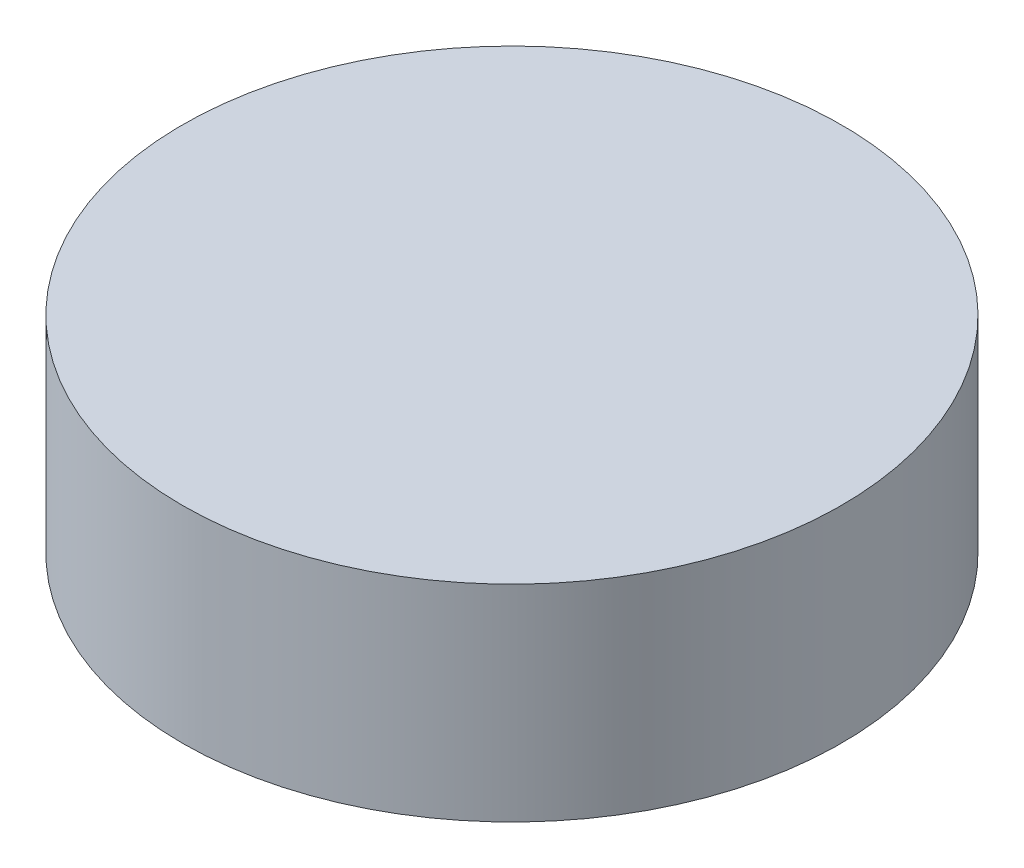
ISO-10303-21;
HEADER;
FILE_DESCRIPTION(('STEP AP214'),'2;1');
FILE_NAME('part.step','',(''),(''),'','','');
FILE_SCHEMA(('AUTOMOTIVE_DESIGN { 1 0 10303 214 1 1 1 1 }'));
ENDSEC;
DATA;
#1=APPLICATION_CONTEXT('core data for automotive mechanical design processes');
#2=APPLICATION_PROTOCOL_DEFINITION('international standard','automotive_design',2000,#1);
#3=PRODUCT_CONTEXT('',#1,'mechanical');
#4=PRODUCT('Part','Part','',(#3));
#5=PRODUCT_RELATED_PRODUCT_CATEGORY('part','',(#4));
#6=PRODUCT_DEFINITION_FORMATION('','',#4);
#7=PRODUCT_DEFINITION_CONTEXT('part definition',#1,'design');
#8=PRODUCT_DEFINITION('design','',#6,#7);
#9=PRODUCT_DEFINITION_SHAPE('','',#8);
#10=(LENGTH_UNIT() NAMED_UNIT(*) SI_UNIT(.MILLI.,.METRE.));
#11=(NAMED_UNIT(*) PLANE_ANGLE_UNIT() SI_UNIT($,.RADIAN.));
#12=(NAMED_UNIT(*) SI_UNIT($,.STERADIAN.) SOLID_ANGLE_UNIT());
#13=UNCERTAINTY_MEASURE_WITH_UNIT(LENGTH_MEASURE(1.E-05),#10,'distance_accuracy_value','');
#14=(GEOMETRIC_REPRESENTATION_CONTEXT(3) GLOBAL_UNCERTAINTY_ASSIGNED_CONTEXT((#13)) GLOBAL_UNIT_ASSIGNED_CONTEXT((#10,
#11,#12)) REPRESENTATION_CONTEXT('',''));
#15=CARTESIAN_POINT('',(0.,0.,0.));
#16=DIRECTION('',(0.,0.,1.));
#17=DIRECTION('',(1.,0.,0.));
#18=AXIS2_PLACEMENT_3D('',#15,#16,#17);
#19=CARTESIAN_POINT('',(0.,0.25,0.));
#20=DIRECTION('',(0.,-1.,0.));
#21=DIRECTION('',(0.,0.,-1.));
#22=AXIS2_PLACEMENT_3D('',#19,#20,#21);
#23=CYLINDRICAL_SURFACE('',#22,0.4);
#24=CARTESIAN_POINT('',(0.,0.25,0.));
#25=DIRECTION('',(0.,1.,0.));
#26=DIRECTION('',(0.,0.,1.));
#27=AXIS2_PLACEMENT_3D('',#24,#25,#26);
#28=CIRCLE('',#27,0.4);
#29=CARTESIAN_POINT('',(0.,0.25,0.4));
#30=VERTEX_POINT('',#29);
#31=EDGE_CURVE('E10',#30,#30,#28,.T.);
#32=ORIENTED_EDGE('',*,*,#31,.F.);
#33=EDGE_LOOP('',(#32));
#34=FACE_BOUND('',#33,.T.);
#35=CARTESIAN_POINT('',(0.,0.,0.));
#36=DIRECTION('',(0.,1.,0.));
#37=DIRECTION('',(0.,0.,1.));
#38=AXIS2_PLACEMENT_3D('',#35,#36,#37);
#39=CIRCLE('',#38,0.4);
#40=CARTESIAN_POINT('',(0.,0.,0.4));
#41=VERTEX_POINT('',#40);
#42=EDGE_CURVE('E34',#41,#41,#39,.T.);
#43=ORIENTED_EDGE('',*,*,#42,.T.);
#44=EDGE_LOOP('',(#43));
#45=FACE_BOUND('',#44,.T.);
#46=ADVANCED_FACE('F31',(#34,#45),#23,.T.);
#47=CARTESIAN_POINT('',(0.,0.25,0.));
#48=DIRECTION('',(0.,1.,0.));
#49=DIRECTION('',(0.,0.,1.));
#50=AXIS2_PLACEMENT_3D('',#47,#48,#49);
#51=PLANE('',#50);
#52=ORIENTED_EDGE('',*,*,#31,.T.);
#53=EDGE_LOOP('',(#52));
#54=FACE_BOUND('',#53,.T.);
#55=ADVANCED_FACE('F46',(#54),#51,.T.);
#56=CARTESIAN_POINT('',(0.,0.,0.));
#57=DIRECTION('',(0.,1.,0.));
#58=DIRECTION('',(0.,0.,1.));
#59=AXIS2_PLACEMENT_3D('',#56,#57,#58);
#60=PLANE('',#59);
#61=ORIENTED_EDGE('',*,*,#42,.F.);
#62=EDGE_LOOP('',(#61));
#63=FACE_BOUND('',#62,.T.);
#64=ADVANCED_FACE('F44',(#63),#60,.F.);
#65=CLOSED_SHELL('',(#46,#55,#64));
#66=MANIFOLD_SOLID_BREP('B2',#65);
#67=ADVANCED_BREP_SHAPE_REPRESENTATION('',(#18,#66),#14);
#68=SHAPE_DEFINITION_REPRESENTATION(#9,#67);
ENDSEC;
END-ISO-10303-21;
